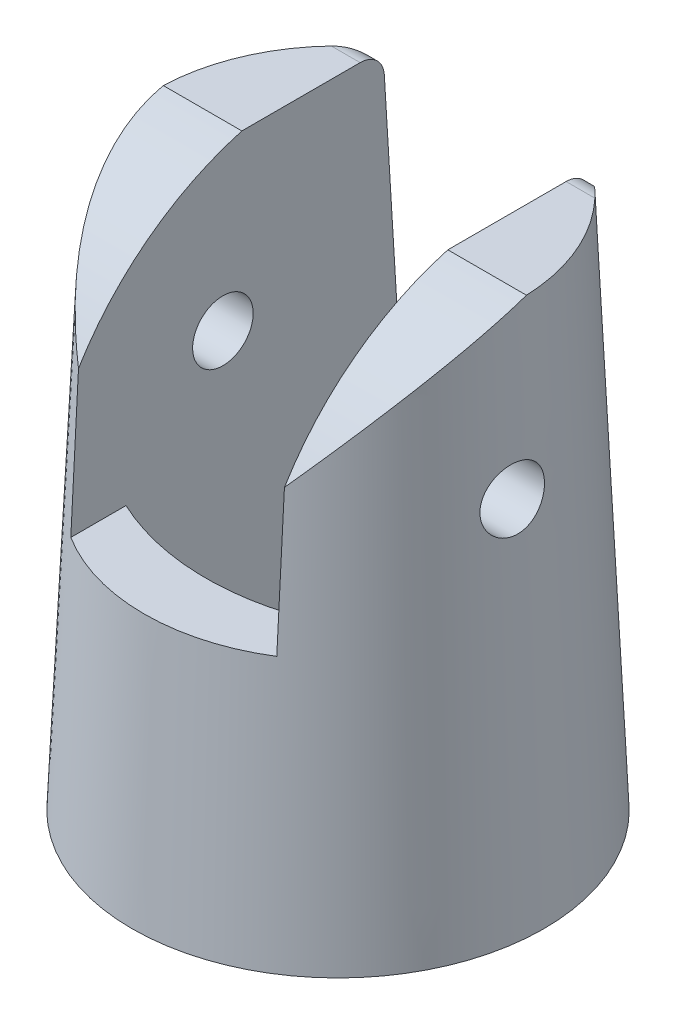
ISO-10303-21;
HEADER;
FILE_DESCRIPTION(('STEP AP214'),'2;1');
FILE_NAME('part.step','',(''),(''),'','','');
FILE_SCHEMA(('AUTOMOTIVE_DESIGN { 1 0 10303 214 1 1 1 1 }'));
ENDSEC;
DATA;
#1=APPLICATION_CONTEXT('core data for automotive mechanical design processes');
#2=APPLICATION_PROTOCOL_DEFINITION('international standard','automotive_design',2000,#1);
#3=PRODUCT_CONTEXT('',#1,'mechanical');
#4=PRODUCT('Part','Part','',(#3));
#5=PRODUCT_RELATED_PRODUCT_CATEGORY('part','',(#4));
#6=PRODUCT_DEFINITION_FORMATION('','',#4);
#7=PRODUCT_DEFINITION_CONTEXT('part definition',#1,'design');
#8=PRODUCT_DEFINITION('design','',#6,#7);
#9=PRODUCT_DEFINITION_SHAPE('','',#8);
#10=(LENGTH_UNIT() NAMED_UNIT(*) SI_UNIT(.MILLI.,.METRE.));
#11=(NAMED_UNIT(*) PLANE_ANGLE_UNIT() SI_UNIT($,.RADIAN.));
#12=(NAMED_UNIT(*) SI_UNIT($,.STERADIAN.) SOLID_ANGLE_UNIT());
#13=UNCERTAINTY_MEASURE_WITH_UNIT(LENGTH_MEASURE(1.E-05),#10,'distance_accuracy_value','');
#14=(GEOMETRIC_REPRESENTATION_CONTEXT(3) GLOBAL_UNCERTAINTY_ASSIGNED_CONTEXT((#13)) GLOBAL_UNIT_ASSIGNED_CONTEXT((#10,
#11,#12)) REPRESENTATION_CONTEXT('',''));
#15=CARTESIAN_POINT('',(0.,0.,0.));
#16=DIRECTION('',(0.,0.,1.));
#17=DIRECTION('',(1.,0.,0.));
#18=AXIS2_PLACEMENT_3D('',#15,#16,#17);
#19=CARTESIAN_POINT('',(-4.25,11.,10.));
#20=DIRECTION('',(0.,1.,0.));
#21=DIRECTION('',(0.,0.,1.));
#22=AXIS2_PLACEMENT_3D('',#19,#20,#21);
#23=PLANE('',#22);
#24=CARTESIAN_POINT('',(0.,11.,-4.55193349511584));
#25=DIRECTION('',(0.,1.,0.));
#26=DIRECTION('',(0.,0.,1.));
#27=AXIS2_PLACEMENT_3D('',#24,#25,#26);
#28=CIRCLE('',#27,10.);
#29=CARTESIAN_POINT('',(-4.25,11.,4.5));
#30=VERTEX_POINT('',#29);
#31=CARTESIAN_POINT('',(4.25,11.,4.5));
#32=VERTEX_POINT('',#31);
#33=EDGE_CURVE('E169',#30,#32,#28,.T.);
#34=ORIENTED_EDGE('',*,*,#33,.F.);
#35=DIRECTION('',(0.,0.,-1.));
#36=VECTOR('',#35,1.);
#37=CARTESIAN_POINT('',(-4.25,11.,10.));
#38=LINE('',#37,#36);
#39=CARTESIAN_POINT('',(-4.25,11.,6.77772085586298));
#40=VERTEX_POINT('',#39);
#41=EDGE_CURVE('E233',#40,#30,#38,.T.);
#42=ORIENTED_EDGE('',*,*,#41,.F.);
#43=CARTESIAN_POINT('',(0.,11.,0.));
#44=DIRECTION('',(0.,1.,0.));
#45=DIRECTION('',(0.,0.,1.));
#46=AXIS2_PLACEMENT_3D('',#43,#44,#45);
#47=CIRCLE('',#46,8.);
#48=CARTESIAN_POINT('',(4.25,11.,6.77772085586298));
#49=VERTEX_POINT('',#48);
#50=EDGE_CURVE('E342',#49,#40,#47,.F.);
#51=ORIENTED_EDGE('',*,*,#50,.F.);
#52=DIRECTION('',(0.,0.,-1.));
#53=VECTOR('',#52,1.);
#54=CARTESIAN_POINT('',(4.25,11.,10.));
#55=LINE('',#54,#53);
#56=EDGE_CURVE('E229',#49,#32,#55,.T.);
#57=ORIENTED_EDGE('',*,*,#56,.T.);
#58=EDGE_LOOP('',(#34,#42,#51,#57));
#59=FACE_BOUND('',#58,.T.);
#60=ADVANCED_FACE('F37',(#59),#23,.T.);
#61=CARTESIAN_POINT('',(0.,22.,0.));
#62=DIRECTION('',(0.,1.,0.));
#63=DIRECTION('',(0.,0.,1.));
#64=AXIS2_PLACEMENT_3D('',#61,#62,#63);
#65=PLANE('',#64);
#66=DIRECTION('',(0.,0.,-1.));
#67=VECTOR('',#66,1.);
#68=CARTESIAN_POINT('',(-4.25,22.,0.));
#69=LINE('',#68,#67);
#70=CARTESIAN_POINT('',(-4.25,22.,-0.282780766378372));
#71=VERTEX_POINT('',#70);
#72=CARTESIAN_POINT('',(-4.25,22.,-5.16422596730198));
#73=VERTEX_POINT('',#72);
#74=EDGE_CURVE('E243',#71,#73,#69,.T.);
#75=ORIENTED_EDGE('',*,*,#74,.T.);
#76=DIRECTION('',(1.,0.,0.));
#77=VECTOR('',#76,1.);
#78=CARTESIAN_POINT('',(-4.35658145321195,22.,-5.16422596730198));
#79=LINE('',#78,#77);
#80=CARTESIAN_POINT('',(-5.438821816591,22.,-5.16422557510443));
#81=VERTEX_POINT('',#80);
#82=EDGE_CURVE('E12',#73,#81,#79,.F.);
#83=ORIENTED_EDGE('',*,*,#82,.T.);
#84=CARTESIAN_POINT('',(0.,22.,0.));
#85=DIRECTION('',(0.,1.,0.));
#86=DIRECTION('',(0.,0.,1.));
#87=AXIS2_PLACEMENT_3D('',#84,#85,#86);
#88=CIRCLE('',#87,7.5);
#89=CARTESIAN_POINT('',(-7.49466710656093,22.,-0.282780766378366));
#90=VERTEX_POINT('',#89);
#91=EDGE_CURVE('E266',#81,#90,#88,.T.);
#92=ORIENTED_EDGE('',*,*,#91,.T.);
#93=DIRECTION('',(-1.,0.,0.));
#94=VECTOR('',#93,1.);
#95=CARTESIAN_POINT('',(10.,22.,-0.282780766378372));
#96=LINE('',#95,#94);
#97=EDGE_CURVE('E223',#71,#90,#96,.T.);
#98=ORIENTED_EDGE('',*,*,#97,.F.);
#99=EDGE_LOOP('',(#75,#83,#92,#98));
#100=FACE_BOUND('',#99,.T.);
#101=ADVANCED_FACE('F301',(#100),#65,.T.);
#102=CARTESIAN_POINT('',(7.49466710656093,22.,-0.282780766378372));
#103=VERTEX_POINT('',#102);
#104=CARTESIAN_POINT('',(5.43882208829554,22.,-5.16422548309984));
#105=VERTEX_POINT('',#104);
#106=EDGE_CURVE('E262',#103,#105,#88,.T.);
#107=ORIENTED_EDGE('',*,*,#106,.T.);
#108=DIRECTION('',(1.,0.,0.));
#109=VECTOR('',#108,1.);
#110=CARTESIAN_POINT('',(4.25,22.,-5.16422596730198));
#111=LINE('',#110,#109);
#112=CARTESIAN_POINT('',(4.25,22.,-5.16422596730198));
#113=VERTEX_POINT('',#112);
#114=EDGE_CURVE('E250',#105,#113,#111,.F.);
#115=ORIENTED_EDGE('',*,*,#114,.T.);
#116=DIRECTION('',(0.,0.,1.));
#117=VECTOR('',#116,1.);
#118=CARTESIAN_POINT('',(4.25,22.,0.));
#119=LINE('',#118,#117);
#120=CARTESIAN_POINT('',(4.25,22.,-0.282780766378372));
#121=VERTEX_POINT('',#120);
#122=EDGE_CURVE('E235',#113,#121,#119,.T.);
#123=ORIENTED_EDGE('',*,*,#122,.T.);
#124=DIRECTION('',(-1.,0.,0.));
#125=VECTOR('',#124,1.);
#126=CARTESIAN_POINT('',(10.,22.,-0.282780766378372));
#127=LINE('',#126,#125);
#128=EDGE_CURVE('E185',#103,#121,#127,.T.);
#129=ORIENTED_EDGE('',*,*,#128,.F.);
#130=EDGE_LOOP('',(#107,#115,#123,#129));
#131=FACE_BOUND('',#130,.T.);
#132=ADVANCED_FACE('F307',(#131),#65,.T.);
#133=CARTESIAN_POINT('',(0.,22.,0.));
#134=DIRECTION('',(0.,-1.,0.));
#135=DIRECTION('',(0.,0.,-1.));
#136=AXIS2_PLACEMENT_3D('',#133,#134,#135);
#137=CONICAL_SURFACE('',#136,7.5,0.0454232794215771);
#138=CARTESIAN_POINT('',(-7.83796735688722,14.3622174893562,-0.379967166316534));
#139=CARTESIAN_POINT('',(-7.84258137245685,14.3133454888,-0.330657672658893));
#140=CARTESIAN_POINT('',(-7.84674066486493,14.2685433740009,-0.277221256144544));
#141=CARTESIAN_POINT('',(-7.8535770197042,14.1883770300518,-0.163551374229647));
#142=CARTESIAN_POINT('',(-7.85625291943775,14.1530202154338,-0.103312621478255));
#143=CARTESIAN_POINT('',(-7.8596375423327,14.0927931436459,0.0222748852102689));
#144=CARTESIAN_POINT('',(-7.86034581452373,14.067925291601,0.0876248070735859));
#145=CARTESIAN_POINT('',(-7.85946228431654,14.0294247957157,0.221525428298114));
#146=CARTESIAN_POINT('',(-7.85787100492778,14.0157895982304,0.290075396410402));
#147=CARTESIAN_POINT('',(-7.85228410719661,14.0001840444117,0.427766064798723));
#148=CARTESIAN_POINT('',(-7.84831020572619,13.9981100486801,0.496895934210147));
#149=CARTESIAN_POINT('',(-7.83806545214515,14.0053392217948,0.634384128941268));
#150=CARTESIAN_POINT('',(-7.83179450336468,14.014642869501,0.702742421664802));
#151=CARTESIAN_POINT('',(-7.81722601313375,14.0443276298967,0.837049248229589));
#152=CARTESIAN_POINT('',(-7.80892100022893,14.0647499293699,0.902987843329569));
#153=CARTESIAN_POINT('',(-7.790775888944,14.1160446525726,1.03043929857791));
#154=CARTESIAN_POINT('',(-7.78093560413196,14.1469183459746,1.09195161990537));
#155=CARTESIAN_POINT('',(-7.76010966108363,14.2190054175936,1.21024682770151));
#156=CARTESIAN_POINT('',(-7.74910385329152,14.2604277357386,1.26689885331061));
#157=CARTESIAN_POINT('',(-7.72687097524336,14.3521248730564,1.37247369304183));
#158=CARTESIAN_POINT('',(-7.71564387723456,14.4024008089463,1.42139553066781));
#159=CARTESIAN_POINT('',(-7.69356264148555,14.5114011926656,1.51095465792816));
#160=CARTESIAN_POINT('',(-7.68271790805299,14.5702531136188,1.55143935878097));
#161=CARTESIAN_POINT('',(-7.6623986074272,14.6941689491704,1.62188693084612));
#162=CARTESIAN_POINT('',(-7.65292397084745,14.7592325489103,1.65185033500368));
#163=CARTESIAN_POINT('',(-7.63612434840078,14.8931135922155,1.70006025493109));
#164=CARTESIAN_POINT('',(-7.628779504597,14.9618887622122,1.71841702637262));
#165=CARTESIAN_POINT('',(-7.61663038843077,15.1017712667087,1.74320996212474));
#166=CARTESIAN_POINT('',(-7.61182564575986,15.1728781668894,1.74964833372071));
#167=CARTESIAN_POINT('',(-7.60511802104365,15.3134015003158,1.75031471224994));
#168=CARTESIAN_POINT('',(-7.60314193334666,15.3828130458677,1.74486034008846));
#169=CARTESIAN_POINT('',(-7.60185272747497,15.5197905645542,1.72250877153392));
#170=CARTESIAN_POINT('',(-7.60253942022953,15.5873566683814,1.70561238765126));
#171=CARTESIAN_POINT('',(-7.60630351713635,15.7179091624343,1.66114648990012));
#172=CARTESIAN_POINT('',(-7.60935259794971,15.7809402068652,1.63370535133399));
#173=CARTESIAN_POINT('',(-7.61736988938797,15.9015696424095,1.5689454281796));
#174=CARTESIAN_POINT('',(-7.62233823791652,15.9591676427765,1.53162593387021));
#175=CARTESIAN_POINT('',(-7.63370221314921,16.0681355426512,1.44760265700419));
#176=CARTESIAN_POINT('',(-7.64011600940821,16.1194120265777,1.40078023978353));
#177=CARTESIAN_POINT('',(-7.65367838854403,16.2134837982302,1.29936472333884));
#178=CARTESIAN_POINT('',(-7.66082704856748,16.2562781941154,1.24477080802427));
#179=CARTESIAN_POINT('',(-7.67534091282203,16.3329515652811,1.12822611342176));
#180=CARTESIAN_POINT('',(-7.68270769514751,16.3666553047501,1.06616013918209));
#181=CARTESIAN_POINT('',(-7.69691604657131,16.423165976049,0.937193488415529));
#182=CARTESIAN_POINT('',(-7.70375760872745,16.4459727638678,0.870292748007196));
#183=CARTESIAN_POINT('',(-7.71644262030627,16.4800561197651,0.73334943158845));
#184=CARTESIAN_POINT('',(-7.72228364732094,16.4913050247458,0.663299734651518));
#185=CARTESIAN_POINT('',(-7.73262752673949,16.5018027282445,0.522209650757891));
#186=CARTESIAN_POINT('',(-7.73713045599583,16.5010522160741,0.451169320942772));
#187=CARTESIAN_POINT('',(-7.74464533464226,16.4875918161016,0.310815334039046));
#188=CARTESIAN_POINT('',(-7.74767065771755,16.4749923395032,0.241491793203629));
#189=CARTESIAN_POINT('',(-7.7523770032345,16.4383254425338,0.105900144542275));
#190=CARTESIAN_POINT('',(-7.75405805542838,16.4142582759914,0.0396319691237624));
#191=CARTESIAN_POINT('',(-7.75633448543182,16.3554710465647,-0.0876438503397964));
#192=CARTESIAN_POINT('',(-7.75693482435448,16.3208005225005,-0.148674301814935));
#193=CARTESIAN_POINT('',(-7.75745954559994,16.2417479395246,-0.264086768502954));
#194=CARTESIAN_POINT('',(-7.75738391180716,16.1973656491035,-0.318468625178237));
#195=CARTESIAN_POINT('',(-7.75702698900383,16.0999847315327,-0.419211339047032));
#196=CARTESIAN_POINT('',(-7.75674504948525,16.0469592633596,-0.465546250063089));
#197=CARTESIAN_POINT('',(-7.75646152768906,15.9338912875552,-0.548673610293639));
#198=CARTESIAN_POINT('',(-7.75645994636058,15.873848756169,-0.585466027202548));
#199=CARTESIAN_POINT('',(-7.75716824579797,15.7483571213731,-0.648511138791821));
#200=CARTESIAN_POINT('',(-7.75787915678735,15.6829003149688,-0.674748494466434));
#201=CARTESIAN_POINT('',(-7.76032771935512,15.5485315888061,-0.715859664595585));
#202=CARTESIAN_POINT('',(-7.76206531536022,15.4796198562436,-0.730734094012506));
#203=CARTESIAN_POINT('',(-7.76670676584568,15.3405207125203,-0.748683187532378));
#204=CARTESIAN_POINT('',(-7.76960720822943,15.2703376022251,-0.751792098543693));
#205=CARTESIAN_POINT('',(-7.77652868962862,15.130481192041,-0.74623974442389));
#206=CARTESIAN_POINT('',(-7.78054994377231,15.0608079926616,-0.737576218456636));
#207=CARTESIAN_POINT('',(-7.78948146542229,14.9238460238463,-0.708730903239069));
#208=CARTESIAN_POINT('',(-7.79439304167692,14.8565609413452,-0.688532062131407));
#209=CARTESIAN_POINT('',(-7.80469362494343,14.7263866758636,-0.637196842199327));
#210=CARTESIAN_POINT('',(-7.8100822334847,14.6634939010552,-0.606069528773817));
#211=CARTESIAN_POINT('',(-7.8193813436165,14.5597286320879,-0.543391023811535));
#212=CARTESIAN_POINT('',(-7.82330433193733,14.5174439551711,-0.514147846605545));
#213=CARTESIAN_POINT('',(-7.83089031896814,14.4367692624713,-0.450678665707523));
#214=CARTESIAN_POINT('',(-7.83455331694851,14.3983792576176,-0.416452648032943));
#215=CARTESIAN_POINT('',(-7.83796735688722,14.3622174893562,-0.379967166316534));
#216=B_SPLINE_CURVE_WITH_KNOTS('',3,(#138,#139,#140,#141,#142,#143,#144,#145,#146,#147,#148,
#149,#150,#151,#152,#153,#154,#155,#156,#157,#158,#159,#160,#161,#162,#163,#164,#165,#166,#167,
#168,#169,#170,#171,#172,#173,#174,#175,#176,#177,#178,#179,#180,#181,#182,#183,#184,#185,#186,
#187,#188,#189,#190,#191,#192,#193,#194,#195,#196,#197,#198,#199,#200,#201,#202,#203,#204,#205,
#206,#207,#208,#209,#210,#211,#212,#213,#214,#215),.UNSPECIFIED.,.T.,.F.,(4,2,2,2,2,2,2,2,2,2,2,
2,2,2,2,2,2,2,2,2,2,2,2,2,2,2,2,2,2,2,2,2,2,2,2,2,2,2,4),(0.,0.208553037536982,
0.417269310681503,0.626033416602672,0.834750048737337,1.04159261254212,1.24844388219199,
1.45606665596537,1.66371466154781,1.87584802928522,2.08800817283941,2.30372407188203,
2.5194290424861,2.73305288682505,2.94663716410913,3.1545872325207,3.36252253570734,
3.56800270522751,3.77349764170112,3.98173607251478,4.18999638674758,4.40202316410761,
4.61405274347573,4.82658862900881,5.03911230536931,5.24967505863844,5.46023315147819,
5.66982216909493,5.87941618344591,6.08967393764611,6.29993240365298,6.51049533073528,
6.72104686132943,6.93098504794489,7.14096355781078,7.3512532707934,7.56136895456365,
7.7156827817969,7.86999704206467),.UNSPECIFIED.);
#217=CARTESIAN_POINT('',(-7.83796735688722,14.3622174893562,-0.379967166316534));
#218=VERTEX_POINT('',#217);
#219=EDGE_CURVE('E513',#218,#218,#216,.T.);
#220=ORIENTED_EDGE('',*,*,#219,.F.);
#221=EDGE_LOOP('',(#220));
#222=FACE_BOUND('',#221,.T.);
#223=CARTESIAN_POINT('',(7.83796735688722,14.3622174893562,-0.379967166316534));
#224=CARTESIAN_POINT('',(7.83328744997076,14.411786493911,-0.429972551895008));
#225=CARTESIAN_POINT('',(7.82813491145327,14.4655970435523,-0.475788374346395));
#226=CARTESIAN_POINT('',(7.81750342359286,14.5801753249335,-0.557736154925303));
#227=CARTESIAN_POINT('',(7.81202413824418,14.6409502797276,-0.593857926863399));
#228=CARTESIAN_POINT('',(7.80132350845169,14.7677115943127,-0.655359958784006));
#229=CARTESIAN_POINT('',(7.79610206849342,14.8336960004513,-0.68074422306178));
#230=CARTESIAN_POINT('',(7.78639291034306,14.9690294601727,-0.720049024368096));
#231=CARTESIAN_POINT('',(7.78190500745661,15.0383776610788,-0.733972450649715));
#232=CARTESIAN_POINT('',(7.77399091836468,15.1783689326216,-0.749929222930623));
#233=CARTESIAN_POINT('',(7.77056291818221,15.2490095693085,-0.751982991142016));
#234=CARTESIAN_POINT('',(7.76489197262361,15.3896780692755,-0.744167192422135));
#235=CARTESIAN_POINT('',(7.76264903265032,15.4597059297606,-0.73429757113135));
#236=CARTESIAN_POINT('',(7.75929248978818,15.5967220156707,-0.702993570327684));
#237=CARTESIAN_POINT('',(7.75817236040506,15.6637256196513,-0.681627146744598));
#238=CARTESIAN_POINT('',(7.75679365361985,15.7932173640281,-0.627974577793197));
#239=CARTESIAN_POINT('',(7.75653508331722,15.8557054672114,-0.5956883424456));
#240=CARTESIAN_POINT('',(7.75649444526569,15.9744166240331,-0.521095827758257));
#241=CARTESIAN_POINT('',(7.7567125622039,16.0306372405351,-0.478785670425266));
#242=CARTESIAN_POINT('',(7.75715624655791,16.1351989223126,-0.38534680301936));
#243=CARTESIAN_POINT('',(7.75738181406936,16.1835398863793,-0.334217979693814));
#244=CARTESIAN_POINT('',(7.75735277244982,16.2710823014537,-0.224452008036307));
#245=CARTESIAN_POINT('',(7.75709699967637,16.31026134601,-0.165796984553421));
#246=CARTESIAN_POINT('',(7.75566157635508,16.3782114671868,-0.0427503856031519));
#247=CARTESIAN_POINT('',(7.75448195024235,16.406982819052,0.0216410381015896));
#248=CARTESIAN_POINT('',(7.75087513937824,16.4532417161059,0.154138010703878));
#249=CARTESIAN_POINT('',(7.74845117341741,16.4707581130484,0.222233573597008));
#250=CARTESIAN_POINT('',(7.74219359590397,16.4941450998807,0.360331220773845));
#251=CARTESIAN_POINT('',(7.73836001268759,16.5000159238554,0.430333266707118));
#252=CARTESIAN_POINT('',(7.72932068479677,16.4999840438097,0.570093595387191));
#253=CARTESIAN_POINT('',(7.72411787249586,16.4941063254208,0.639852080057968));
#254=CARTESIAN_POINT('',(7.71255950790742,16.4708408417028,0.777323498526293));
#255=CARTESIAN_POINT('',(7.70620390189043,16.4534525397877,0.845036336808613));
#256=CARTESIAN_POINT('',(7.69269658051719,16.4075370442686,0.976990666341749));
#257=CARTESIAN_POINT('',(7.68553992325761,16.3789376360297,1.04120651486163));
#258=CARTESIAN_POINT('',(7.67101803808324,16.3114123472423,1.16393536511896));
#259=CARTESIAN_POINT('',(7.66365279507404,16.2724857176454,1.22244795276949));
#260=CARTESIAN_POINT('',(7.64930430545073,16.1849979103186,1.33262702154622));
#261=CARTESIAN_POINT('',(7.64232472712915,16.1363596199086,1.38423279897497));
#262=CARTESIAN_POINT('',(7.62951784340339,16.0309808458313,1.4785542987219));
#263=CARTESIAN_POINT('',(7.62369050222643,15.9742406137942,1.52127029703761));
#264=CARTESIAN_POINT('',(7.61388677149647,15.8546071582144,1.59631412815498));
#265=CARTESIAN_POINT('',(7.60989910971896,15.7917543426828,1.62870483824421));
#266=CARTESIAN_POINT('',(7.60426405732497,15.6614026873648,1.68246189666889));
#267=CARTESIAN_POINT('',(7.60261632102336,15.5939045353947,1.70382987313305));
#268=CARTESIAN_POINT('',(7.60201413428632,15.4576064065578,1.73457894238311));
#269=CARTESIAN_POINT('',(7.60300775882109,15.3888575301053,1.74418579213573));
#270=CARTESIAN_POINT('',(7.60767099089208,15.2508115759145,1.75190966695364));
#271=CARTESIAN_POINT('',(7.61134043696361,15.1815145315033,1.75002738524674));
#272=CARTESIAN_POINT('',(7.62115557547188,15.0449328497942,1.73496140239145));
#273=CARTESIAN_POINT('',(7.62728047676171,14.9776362883151,1.72187156798986));
#274=CARTESIAN_POINT('',(7.6416294406344,14.8462855334842,1.68497664018864));
#275=CARTESIAN_POINT('',(7.64985369677373,14.7822316397532,1.66117055861715));
#276=CARTESIAN_POINT('',(7.66801243401358,14.6579498642628,1.6030701895091));
#277=CARTESIAN_POINT('',(7.6779742216434,14.5978081122334,1.56860035291659));
#278=CARTESIAN_POINT('',(7.69881665045785,14.4841316963163,1.49030840998256));
#279=CARTESIAN_POINT('',(7.70969743522397,14.4305980680908,1.44648484060131));
#280=CARTESIAN_POINT('',(7.73191396506617,14.3302369345709,1.34942943943223));
#281=CARTESIAN_POINT('',(7.74325425905537,14.2836130542963,1.29598786361171));
#282=CARTESIAN_POINT('',(7.76532822275802,14.200004007431,1.18191600547704));
#283=CARTESIAN_POINT('',(7.77606186415307,14.1630192905038,1.12128538798862));
#284=CARTESIAN_POINT('',(7.79623886870943,14.0996284747101,0.994176429544855));
#285=CARTESIAN_POINT('',(7.80567632874684,14.073269780279,0.927673462984205));
#286=CARTESIAN_POINT('',(7.82259046158376,14.0322318910173,0.790920827608197));
#287=CARTESIAN_POINT('',(7.83006744861704,14.017550823674,0.720671761410059));
#288=CARTESIAN_POINT('',(7.84250930031314,14.0005847034211,0.579912298187302));
#289=CARTESIAN_POINT('',(7.84752147606881,13.9980572854591,0.509435309955935));
#290=CARTESIAN_POINT('',(7.85506980203676,14.0049041647396,0.3689156843286));
#291=CARTESIAN_POINT('',(7.85760577766391,14.0142793010676,0.298873077904731));
#292=CARTESIAN_POINT('',(7.86022591507369,14.0444071543172,0.162619905603529));
#293=CARTESIAN_POINT('',(7.86035508572819,14.0649435994135,0.096362149741156));
#294=CARTESIAN_POINT('',(7.85853055532961,14.1166536842147,-0.0317812303583431));
#295=CARTESIAN_POINT('',(7.85657877647283,14.1478174892377,-0.0936708332501011));
#296=CARTESIAN_POINT('',(7.85185318686241,14.2090525709101,-0.193735923866125));
#297=CARTESIAN_POINT('',(7.84950029916606,14.2366587523309,-0.233464626389801));
#298=CARTESIAN_POINT('',(7.844161430126,14.2962513658329,-0.309440878422375));
#299=CARTESIAN_POINT('',(7.84117544129214,14.3282378497355,-0.345688386738222));
#300=CARTESIAN_POINT('',(7.83796735688722,14.3622174893562,-0.379967166316534));
#301=B_SPLINE_CURVE_WITH_KNOTS('',3,(#223,#224,#225,#226,#227,#228,#229,#230,#231,#232,#233,
#234,#235,#236,#237,#238,#239,#240,#241,#242,#243,#244,#245,#246,#247,#248,#249,#250,#251,#252,
#253,#254,#255,#256,#257,#258,#259,#260,#261,#262,#263,#264,#265,#266,#267,#268,#269,#270,#271,
#272,#273,#274,#275,#276,#277,#278,#279,#280,#281,#282,#283,#284,#285,#286,#287,#288,#289,#290,
#291,#292,#293,#294,#295,#296,#297,#298,#299,#300),.UNSPECIFIED.,.T.,.F.,(4,2,2,2,2,2,2,2,2,2,2,
2,2,2,2,2,2,2,2,2,2,2,2,2,2,2,2,2,2,2,2,2,2,2,2,2,2,2,4),(0.,0.211521205247813,
0.423263807442014,0.634927375558793,0.846537567380181,1.0577835669305,1.26903052956875,
1.47904234258002,1.68905588613143,1.89915081148957,2.10924843516682,2.31985462343067,
2.53045524153484,2.74051381413052,2.95056816434615,3.16017626716106,3.36979414190905,
3.58078503094666,3.79179122764584,4.00454472861511,4.2172916233229,4.4287170558575,
4.6401112505464,4.84738064458982,5.05463753259738,5.26017537178874,5.46573216802022,
5.67487122393724,5.8840430157978,6.09850004920052,6.31296708515513,6.52838057854262,
6.74375952331146,6.95482510378299,7.16590556441396,7.37303463285966,7.57997253949852,
7.72496898140106,7.86996713883852),.UNSPECIFIED.);
#302=CARTESIAN_POINT('',(7.83796735688722,14.3622174893562,-0.379967166316534));
#303=VERTEX_POINT('',#302);
#304=EDGE_CURVE('E507',#303,#303,#301,.T.);
#305=ORIENTED_EDGE('',*,*,#304,.F.);
#306=EDGE_LOOP('',(#305));
#307=FACE_BOUND('',#306,.T.);
#308=CARTESIAN_POINT('',(0.,41.3966504623758,-4.91858206978573));
#309=DIRECTION('',(0.,-0.061048539534854,0.998134798421867));
#310=DIRECTION('',(0.,-0.998134798421867,-0.061048539534854));
#311=AXIS2_PLACEMENT_3D('',#308,#309,#310);
#312=ELLIPSE('',#311,108.411013929554,4.42830625448101);
#313=CARTESIAN_POINT('',(4.34940519150883,21.0610485395348,-6.16236076572385));
#314=VERTEX_POINT('',#313);
#315=CARTESIAN_POINT('',(4.25,11.,-6.77772085586298));
#316=VERTEX_POINT('',#315);
#317=EDGE_CURVE('E171',#314,#316,#312,.F.);
#318=ORIENTED_EDGE('',*,*,#317,.F.);
#319=CARTESIAN_POINT('',(4.34940519150883,21.0610485395349,-6.16236076572385));
#320=CARTESIAN_POINT('',(4.34960668817625,21.0960037714882,-6.16026639709529));
#321=CARTESIAN_POINT('',(4.35255770840583,21.1307027635223,-6.15626033932825));
#322=CARTESIAN_POINT('',(4.36323729220071,21.1984264149009,-6.14492437754313));
#323=CARTESIAN_POINT('',(4.37091464928772,21.2314649684895,-6.13763032047632));
#324=CARTESIAN_POINT('',(4.3927674187493,21.3034159998716,-6.11798905969393));
#325=CARTESIAN_POINT('',(4.40808163224176,21.3417552703831,-6.10483757135849));
#326=CARTESIAN_POINT('',(4.44349099131189,21.4147941627066,-6.07500114310349));
#327=CARTESIAN_POINT('',(4.46360781026385,21.4494762264571,-6.05830022381533));
#328=CARTESIAN_POINT('',(4.51834985809759,21.5317973235916,-6.01298583576456));
#329=CARTESIAN_POINT('',(4.55514250711387,21.5770255303745,-5.98264043640866));
#330=CARTESIAN_POINT('',(4.63324615227983,21.6597061595097,-5.91759225288077));
#331=CARTESIAN_POINT('',(4.67456645627655,21.6971420868919,-5.8828804698848));
#332=CARTESIAN_POINT('',(4.78221980236055,21.7828896509989,-5.79100629877273));
#333=CARTESIAN_POINT('',(4.8503074683537,21.8266110984243,-5.73161575598004));
#334=CARTESIAN_POINT('',(4.98881469902542,21.8995032525744,-5.60704864762353));
#335=CARTESIAN_POINT('',(5.05923576587386,21.9286643838315,-5.54186830754522));
#336=CARTESIAN_POINT('',(5.18172123590552,21.9668930634414,-5.4247129010371));
#337=CARTESIAN_POINT('',(5.23375859656191,21.9792240430582,-5.37375512147988));
#338=CARTESIAN_POINT('',(5.33701405608624,21.9957402272397,-5.27015891537571));
#339=CARTESIAN_POINT('',(5.38823463353786,21.9999585068014,-5.21752820599083));
#340=CARTESIAN_POINT('',(5.43882157834542,21.9999999999995,-5.16422499886717));
#341=B_SPLINE_CURVE_WITH_KNOTS('',3,(#319,#320,#321,#322,#323,#324,#325,#326,#327,#328,#329,
#330,#331,#332,#333,#334,#335,#336,#337,#338,#339,#340),.UNSPECIFIED.,.F.,.F.,(4,2,2,2,2,2,2,2,
2,2,4),(0.,0.104713635229163,0.208312266464569,0.337583019397058,0.467448560866493,
0.663534383733636,0.860031158880604,1.15956187798788,1.45928932231263,1.6804477134348,
1.9007025274968),.UNSPECIFIED.);
#342=EDGE_CURVE('E253',#314,#105,#341,.T.);
#343=ORIENTED_EDGE('',*,*,#342,.T.);
#344=ORIENTED_EDGE('',*,*,#106,.F.);
#345=CARTESIAN_POINT('',(3.92629643649929,16.4998,6.68182888151938));
#346=CARTESIAN_POINT('',(4.01931564514,16.6087596912144,6.62142155513562));
#347=CARTESIAN_POINT('',(4.11131934328455,16.7173930395185,6.55888032044954));
#348=CARTESIAN_POINT('',(4.2932260178552,16.9338412713703,6.42945464521689));
#349=CARTESIAN_POINT('',(4.38312886202439,17.0416561031024,6.36256993222782));
#350=CARTESIAN_POINT('',(4.64974442688335,17.3638214077866,6.15515905521457));
#351=CARTESIAN_POINT('',(4.82317510446661,17.5766708748424,6.00799843905382));
#352=CARTESIAN_POINT('',(5.16169686386746,17.9988471466584,5.69400575303419));
#353=CARTESIAN_POINT('',(5.32669369672939,18.208121685456,5.52700099956619));
#354=CARTESIAN_POINT('',(5.64481535638337,18.6193198754499,5.17407572809778));
#355=CARTESIAN_POINT('',(5.79794544197142,18.8212467614988,4.98816367438537));
#356=CARTESIAN_POINT('',(6.18554186312356,19.344583308023,4.46948304084846));
#357=CARTESIAN_POINT('',(6.40828324022354,19.6584689169281,4.11972189091382));
#358=CARTESIAN_POINT('',(6.70460657922282,20.1030052689049,3.55584345351292));
#359=CARTESIAN_POINT('',(6.79701231639435,20.2466767825226,3.36154965453657));
#360=CARTESIAN_POINT('',(6.96755426977346,20.5240954336224,2.95998057341705));
#361=CARTESIAN_POINT('',(7.04569416904946,20.6578451273514,2.7527086604966));
#362=CARTESIAN_POINT('',(7.17256638181405,20.8899099716306,2.36580838957839));
#363=CARTESIAN_POINT('',(7.22406541289287,20.9901763018322,2.18825189066998));
#364=CARTESIAN_POINT('',(7.31510853322135,21.1822314807992,1.82566056472446));
#365=CARTESIAN_POINT('',(7.35465549431912,21.2740223623616,1.64062754628174));
#366=CARTESIAN_POINT('',(7.42056862050664,21.4481005988231,1.26431410365367));
#367=CARTESIAN_POINT('',(7.44696120414356,21.5304067445339,1.0730470299074));
#368=CARTESIAN_POINT('',(7.48555616887137,21.6848871796944,0.68514833352627));
#369=CARTESIAN_POINT('',(7.49776772335813,21.757067992397,0.48852026316183));
#370=CARTESIAN_POINT('',(7.50462208608418,21.8557629190509,0.195068954102029));
#371=CARTESIAN_POINT('',(7.50510898755003,21.8864428593324,0.0997400677496214));
#372=CARTESIAN_POINT('',(7.50253793378852,21.9452762371562,-0.0915936069798442));
#373=CARTESIAN_POINT('',(7.49948176524655,21.9734309404044,-0.187598030443378));
#374=CARTESIAN_POINT('',(7.49461138166237,22.0003080623876,-0.28388412339532));
#375=B_SPLINE_CURVE_WITH_KNOTS('',3,(#345,#346,#347,#348,#349,#350,#351,#352,#353,#354,#355,
#356,#357,#358,#359,#360,#361,#362,#363,#364,#365,#366,#367,#368,#369,#370,#371,#372,#373,#374),
.UNSPECIFIED.,.F.,.F.,(4,2,2,2,2,2,2,2,2,2,2,2,2,2,4),(0.,0.466403210186573,0.932835703589585,
1.86664716605778,2.8092792869606,3.75149125909967,5.30530822586806,6.08073041777247,
6.85595213185147,7.48631450141871,8.11652528662495,8.74546523819607,9.37399811531518,
9.67435061674296,9.97455172345294),.UNSPECIFIED.);
#376=CARTESIAN_POINT('',(4.25,16.8824851749416,6.45993994327909));
#377=VERTEX_POINT('',#376);
#378=EDGE_CURVE('E183',#377,#103,#375,.T.);
#379=ORIENTED_EDGE('',*,*,#378,.F.);
#380=CARTESIAN_POINT('',(4.24999999999999,28.8057765116834,5.80024977110232));
#381=CARTESIAN_POINT('',(4.24999999999999,26.2989672472569,5.9414803133123));
#382=CARTESIAN_POINT('',(4.25,23.7920608816099,6.08097461329277));
#383=CARTESIAN_POINT('',(4.25,18.7780890989142,6.35703244550604));
#384=CARTESIAN_POINT('',(4.25,16.2710236820206,6.49359598055445));
#385=CARTESIAN_POINT('',(4.25,11.2567649375485,6.76433422535382));
#386=CARTESIAN_POINT('',(4.25,8.74957161001142,6.89850893587335));
#387=CARTESIAN_POINT('',(4.25,3.73507492544163,7.16483292436775));
#388=CARTESIAN_POINT('',(4.25,1.22777156830585,7.29698220040266));
#389=CARTESIAN_POINT('',(4.25,-1.27957505847372,7.42830030504297));
#390=B_SPLINE_CURVE_WITH_KNOTS('',3,(#380,#381,#382,#383,#384,#385,#386,#387,#388,#389),
.UNSPECIFIED.,.F.,.F.,(4,2,2,2,4),(0.,7.5323518408429,15.0646964449593,22.5970386255993,
30.129388020287),.UNSPECIFIED.);
#391=EDGE_CURVE('E347',#377,#49,#390,.T.);
#392=ORIENTED_EDGE('',*,*,#391,.T.);
#393=ORIENTED_EDGE('',*,*,#50,.T.);
#394=CARTESIAN_POINT('',(-4.25,-1.27957505847371,7.42830030504297));
#395=CARTESIAN_POINT('',(-4.25,1.22777156830585,7.29698220040253));
#396=CARTESIAN_POINT('',(-4.25,3.73507492544163,7.16483292436767));
#397=CARTESIAN_POINT('',(-4.25,8.74957161001142,6.89850893587343));
#398=CARTESIAN_POINT('',(-4.25,11.2567649375485,6.764334225354));
#399=CARTESIAN_POINT('',(-4.25,16.2710236820206,6.49359598055463));
#400=CARTESIAN_POINT('',(-4.25,18.7780890989142,6.35703244550611));
#401=CARTESIAN_POINT('',(-4.25,23.7920608816099,6.08097461329268));
#402=CARTESIAN_POINT('',(-4.25000000000001,26.2989672472569,5.94148031331217));
#403=CARTESIAN_POINT('',(-4.25,28.8057765116834,5.80024977110231));
#404=B_SPLINE_CURVE_WITH_KNOTS('',3,(#394,#395,#396,#397,#398,#399,#400,#401,#402,#403),
.UNSPECIFIED.,.F.,.F.,(4,2,2,2,4),(0.,7.53234939468772,15.0646915753277,22.5970361794441,
30.129388020287),.UNSPECIFIED.);
#405=CARTESIAN_POINT('',(-4.25,16.8824851749416,6.45993994327909));
#406=VERTEX_POINT('',#405);
#407=EDGE_CURVE('E340',#40,#406,#404,.T.);
#408=ORIENTED_EDGE('',*,*,#407,.T.);
#409=CARTESIAN_POINT('',(-7.49461138166237,22.0003080623876,-0.28388412339532));
#410=CARTESIAN_POINT('',(-7.49988309951068,21.9712190846278,-0.179671951668641));
#411=CARTESIAN_POINT('',(-7.50302890185525,21.9406327300934,-0.0757903670246975));
#412=CARTESIAN_POINT('',(-7.50517997220749,21.876530339592,0.13109451540663));
#413=CARTESIAN_POINT('',(-7.50418576359576,21.8430146744732,0.234097922563612));
#414=CARTESIAN_POINT('',(-7.49516957751024,21.7382570709262,0.54121921764491));
#415=CARTESIAN_POINT('',(-7.48112808840113,21.6627231332624,0.743739635876401));
#416=CARTESIAN_POINT('',(-7.43828077256935,21.5017611807683,1.14094177768584));
#417=CARTESIAN_POINT('',(-7.40961241381115,21.4164309208909,1.33567859826578));
#418=CARTESIAN_POINT('',(-7.33878245591829,21.2361607157852,1.71816731631631));
#419=CARTESIAN_POINT('',(-7.29661717605367,21.1412181540315,1.90591729280399));
#420=CARTESIAN_POINT('',(-7.20026737266868,20.9431335214884,2.27261940341223));
#421=CARTESIAN_POINT('',(-7.1461407509817,20.8400324372421,2.45160901155736));
#422=CARTESIAN_POINT('',(-7.02698361077534,20.6261840787999,2.80110168903546));
#423=CARTESIAN_POINT('',(-6.96195399000715,20.5154374345796,2.97160545559348));
#424=CARTESIAN_POINT('',(-6.75179546283551,20.1723044580087,3.47084807264812));
#425=CARTESIAN_POINT('',(-6.59184775246264,19.9295259920633,3.78640217377691));
#426=CARTESIAN_POINT('',(-6.27814664729068,19.476767736348,4.31768661392711));
#427=CARTESIAN_POINT('',(-6.13025157024551,19.2707265163302,4.54040677859332));
#428=CARTESIAN_POINT('',(-5.81823735113368,18.8479886062566,4.96354041807549));
#429=CARTESIAN_POINT('',(-5.65410913328027,18.6312859899342,5.16394127976161));
#430=CARTESIAN_POINT('',(-5.31234904088311,18.1896276284259,5.54273628503243));
#431=CARTESIAN_POINT('',(-5.13471803279778,17.9646724132781,5.72113183874884));
#432=CARTESIAN_POINT('',(-4.76799729772391,17.5085184045354,6.05655537735724));
#433=CARTESIAN_POINT('',(-4.57891334851169,17.2773227911971,6.21359400873509));
#434=CARTESIAN_POINT('',(-4.30977503143093,16.9537346128282,6.41700145308093));
#435=CARTESIAN_POINT('',(-4.23399982905615,16.8632054471757,6.47215899836824));
#436=CARTESIAN_POINT('',(-4.08115145722696,16.6817932779821,6.57931295355229));
#437=CARTESIAN_POINT('',(-4.00408158775142,16.5909115269953,6.63131618955329));
#438=CARTESIAN_POINT('',(-3.92629643649941,16.4997999999999,6.68182888151944));
#439=B_SPLINE_CURVE_WITH_KNOTS('',3,(#409,#410,#411,#412,#413,#414,#415,#416,#417,#418,#419,
#420,#421,#422,#423,#424,#425,#426,#427,#428,#429,#430,#431,#432,#433,#434,#435,#436,#437,#438),
.UNSPECIFIED.,.F.,.F.,(4,2,2,2,2,2,2,2,2,2,2,2,2,2,4),(0.,0.324904791494705,0.649768509741711,
1.29859079449086,1.94142458372872,2.58443382900467,3.22439607689719,3.8643056562566,
5.14731722375654,6.15868823098563,7.17062791680593,8.18250272235386,9.19387124187545,
9.58475718585292,9.97476460463198),.UNSPECIFIED.);
#440=EDGE_CURVE('E221',#90,#406,#439,.T.);
#441=ORIENTED_EDGE('',*,*,#440,.F.);
#442=ORIENTED_EDGE('',*,*,#91,.F.);
#443=CARTESIAN_POINT('',(-5.43882140354224,21.9999999999997,-5.16422518296511));
#444=CARTESIAN_POINT('',(-5.40122433759026,21.999988003325,-5.20383005545125));
#445=CARTESIAN_POINT('',(-5.363273983719,21.9976475021436,-5.24307901185124));
#446=CARTESIAN_POINT('',(-5.28693546590571,21.9884676916384,-5.32063117425542));
#447=CARTESIAN_POINT('',(-5.24854721730837,21.9816274974216,-5.35893419269737));
#448=CARTESIAN_POINT('',(-5.17127647154873,21.9635269369551,-5.43467828088518));
#449=CARTESIAN_POINT('',(-5.13239260596844,21.9522280107373,-5.47210873056732));
#450=CARTESIAN_POINT('',(-5.05479542039122,21.9252776384547,-5.54552571918466));
#451=CARTESIAN_POINT('',(-5.01608206782365,21.9096270638205,-5.58151254556044));
#452=CARTESIAN_POINT('',(-4.91611870549029,21.8632611799505,-5.67291560545297));
#453=CARTESIAN_POINT('',(-4.85525150425467,21.8291362822063,-5.72706601404808));
#454=CARTESIAN_POINT('',(-4.73700759106297,21.7490533016696,-5.82992881193552));
#455=CARTESIAN_POINT('',(-4.67961922184138,21.7031377874961,-5.8786598784777));
#456=CARTESIAN_POINT('',(-4.59414942754881,21.619557864228,-5.95022715826893));
#457=CARTESIAN_POINT('',(-4.56374880396903,21.5863107740471,-5.97544919517086));
#458=CARTESIAN_POINT('',(-4.50666004104456,21.5146667784949,-6.02268787020086));
#459=CARTESIAN_POINT('',(-4.47996861603082,21.4762744908226,-6.04470734602655));
#460=CARTESIAN_POINT('',(-4.4376145251762,21.403376261858,-6.07994105728665));
#461=CARTESIAN_POINT('',(-4.4208227260574,21.369953905225,-6.09402052716762));
#462=CARTESIAN_POINT('',(-4.39183504171262,21.3000849240776,-6.11885386930183));
#463=CARTESIAN_POINT('',(-4.37962334642295,21.2636492430545,-6.12961915827847));
#464=CARTESIAN_POINT('',(-4.36374806339614,21.1994932868563,-6.1445024636423));
#465=CARTESIAN_POINT('',(-4.35862572076484,21.1723707491004,-6.14964452883512));
#466=CARTESIAN_POINT('',(-4.35153841039485,21.1172304633356,-6.15772915553273));
#467=CARTESIAN_POINT('',(-4.34959278287488,21.0892082831502,-6.16065818627183));
#468=CARTESIAN_POINT('',(-4.34940519150883,21.0610485395349,-6.16236076572385));
#469=B_SPLINE_CURVE_WITH_KNOTS('',3,(#443,#444,#445,#446,#447,#448,#449,#450,#451,#452,#453,
#454,#455,#456,#457,#458,#459,#460,#461,#462,#463,#464,#465,#466,#467,#468),.UNSPECIFIED.,.F.,
.F.,(4,2,2,2,2,2,2,2,2,2,2,2,4),(0.,0.163752003230833,0.327536218961529,0.492769055887859,
0.657968828250649,0.92206694623714,1.18522465633728,1.33975800572197,1.49415358224955,
1.61364458887856,1.73271924287742,1.81668582207121,1.90116171903801),.UNSPECIFIED.);
#470=CARTESIAN_POINT('',(-4.34940519150883,21.0610485395349,-6.16236076572385));
#471=VERTEX_POINT('',#470);
#472=EDGE_CURVE('E388',#81,#471,#469,.T.);
#473=ORIENTED_EDGE('',*,*,#472,.T.);
#474=CARTESIAN_POINT('',(-4.25,11.,-6.77772085586298));
#475=VERTEX_POINT('',#474);
#476=EDGE_CURVE('E180',#475,#471,#312,.F.);
#477=ORIENTED_EDGE('',*,*,#476,.F.);
#478=EDGE_CURVE('E334',#475,#316,#47,.F.);
#479=ORIENTED_EDGE('',*,*,#478,.T.);
#480=EDGE_LOOP('',(#318,#343,#344,#379,#392,#393,#408,#441,#442,#473,#477,#479));
#481=FACE_BOUND('',#480,.T.);
#482=CARTESIAN_POINT('',(0.,0.,0.));
#483=DIRECTION('',(0.,1.,0.));
#484=DIRECTION('',(0.,0.,1.));
#485=AXIS2_PLACEMENT_3D('',#482,#483,#484);
#486=CIRCLE('',#485,8.5);
#487=CARTESIAN_POINT('',(0.,0.,8.5));
#488=VERTEX_POINT('',#487);
#489=EDGE_CURVE('E265',#488,#488,#486,.T.);
#490=ORIENTED_EDGE('',*,*,#489,.T.);
#491=EDGE_LOOP('',(#490));
#492=FACE_BOUND('',#491,.T.);
#493=ADVANCED_FACE('F195',(#222,#307,#481,#492),#137,.T.);
#494=CARTESIAN_POINT('',(0.,0.,0.));
#495=DIRECTION('',(0.,1.,0.));
#496=DIRECTION('',(0.,0.,1.));
#497=AXIS2_PLACEMENT_3D('',#494,#495,#496);
#498=PLANE('',#497);
#499=DIRECTION('',(0.,0.,-1.));
#500=VECTOR('',#499,1.);
#501=CARTESIAN_POINT('',(-4.25,0.,4.5));
#502=LINE('',#501,#500);
#503=CARTESIAN_POINT('',(-4.25,0.,4.5));
#504=VERTEX_POINT('',#503);
#505=CARTESIAN_POINT('',(-4.25,0.,-4.5));
#506=VERTEX_POINT('',#505);
#507=EDGE_CURVE('E149',#504,#506,#502,.T.);
#508=ORIENTED_EDGE('',*,*,#507,.F.);
#509=CARTESIAN_POINT('',(0.,0.,-4.55193349511584));
#510=DIRECTION('',(0.,-1.,0.));
#511=DIRECTION('',(0.,0.,1.));
#512=AXIS2_PLACEMENT_3D('',#509,#510,#511);
#513=CIRCLE('',#512,10.);
#514=CARTESIAN_POINT('',(4.25,0.,4.5));
#515=VERTEX_POINT('',#514);
#516=EDGE_CURVE('E154',#515,#504,#513,.T.);
#517=ORIENTED_EDGE('',*,*,#516,.F.);
#518=DIRECTION('',(0.,0.,1.));
#519=VECTOR('',#518,1.);
#520=CARTESIAN_POINT('',(4.25,0.,4.5));
#521=LINE('',#520,#519);
#522=CARTESIAN_POINT('',(4.25,0.,-4.5));
#523=VERTEX_POINT('',#522);
#524=EDGE_CURVE('E159',#523,#515,#521,.T.);
#525=ORIENTED_EDGE('',*,*,#524,.F.);
#526=CARTESIAN_POINT('',(0.,0.,4.55193349511584));
#527=DIRECTION('',(0.,-1.,0.));
#528=DIRECTION('',(0.,0.,1.));
#529=AXIS2_PLACEMENT_3D('',#526,#527,#528);
#530=CIRCLE('',#529,10.);
#531=EDGE_CURVE('E138',#506,#523,#530,.T.);
#532=ORIENTED_EDGE('',*,*,#531,.F.);
#533=EDGE_LOOP('',(#508,#517,#525,#532));
#534=FACE_BOUND('',#533,.T.);
#535=ORIENTED_EDGE('',*,*,#489,.F.);
#536=EDGE_LOOP('',(#535));
#537=FACE_BOUND('',#536,.T.);
#538=ADVANCED_FACE('F156',(#534,#537),#498,.F.);
#539=CARTESIAN_POINT('',(-4.25000000000001,35.609106296612,10.));
#540=DIRECTION('',(1.,0.,0.));
#541=DIRECTION('',(0.,1.,0.));
#542=AXIS2_PLACEMENT_3D('',#539,#540,#541);
#543=PLANE('',#542);
#544=CARTESIAN_POINT('',(-4.25000000000001,15.25,0.5));
#545=DIRECTION('',(1.,0.,0.));
#546=DIRECTION('',(0.,1.,0.));
#547=AXIS2_PLACEMENT_3D('',#544,#545,#546);
#548=CIRCLE('',#547,1.25);
#549=CARTESIAN_POINT('',(-4.25000000000001,16.5,0.5));
#550=VERTEX_POINT('',#549);
#551=EDGE_CURVE('E522',#550,#550,#548,.T.);
#552=ORIENTED_EDGE('',*,*,#551,.F.);
#553=EDGE_LOOP('',(#552));
#554=FACE_BOUND('',#553,.T.);
#555=DIRECTION('',(0.,-0.998134798421867,-0.061048539534854));
#556=VECTOR('',#555,1.);
#557=CARTESIAN_POINT('',(-4.25000000000001,36.5397349355926,-5.21564374925335));
#558=LINE('',#557,#556);
#559=CARTESIAN_POINT('',(-4.25,21.0610485395349,-6.16236076572385));
#560=VERTEX_POINT('',#559);
#561=EDGE_CURVE('E174',#560,#475,#558,.T.);
#562=ORIENTED_EDGE('',*,*,#561,.F.);
#563=CARTESIAN_POINT('',(-4.25,21.,-5.16422596730198));
#564=DIRECTION('',(1.,0.,0.));
#565=DIRECTION('',(0.,1.,0.));
#566=AXIS2_PLACEMENT_3D('',#563,#564,#565);
#567=CIRCLE('',#566,1.);
#568=EDGE_CURVE('E47',#560,#73,#567,.T.);
#569=ORIENTED_EDGE('',*,*,#568,.T.);
#570=ORIENTED_EDGE('',*,*,#74,.F.);
#571=CARTESIAN_POINT('',(-4.25,10.9237834170715,-3.37590640366814));
#572=DIRECTION('',(1.,0.,0.));
#573=DIRECTION('',(0.,1.,0.));
#574=AXIS2_PLACEMENT_3D('',#571,#572,#573);
#575=CIRCLE('',#574,11.5);
#576=EDGE_CURVE('E398',#406,#71,#575,.F.);
#577=ORIENTED_EDGE('',*,*,#576,.F.);
#578=ORIENTED_EDGE('',*,*,#407,.F.);
#579=ORIENTED_EDGE('',*,*,#41,.T.);
#580=DIRECTION('',(0.,-1.,0.));
#581=VECTOR('',#580,1.);
#582=CARTESIAN_POINT('',(-4.25,14.,4.5));
#583=LINE('',#582,#581);
#584=EDGE_CURVE('E145',#30,#504,#583,.T.);
#585=ORIENTED_EDGE('',*,*,#584,.T.);
#586=ORIENTED_EDGE('',*,*,#507,.T.);
#587=DIRECTION('',(0.,-1.,0.));
#588=VECTOR('',#587,1.);
#589=CARTESIAN_POINT('',(-4.25,14.,-4.5));
#590=LINE('',#589,#588);
#591=CARTESIAN_POINT('',(-4.25,11.,-4.5));
#592=VERTEX_POINT('',#591);
#593=EDGE_CURVE('E134',#592,#506,#590,.T.);
#594=ORIENTED_EDGE('',*,*,#593,.F.);
#595=EDGE_CURVE('E232',#592,#475,#38,.T.);
#596=ORIENTED_EDGE('',*,*,#595,.T.);
#597=EDGE_LOOP('',(#562,#569,#570,#577,#578,#579,#585,#586,#594,#596));
#598=FACE_BOUND('',#597,.T.);
#599=ADVANCED_FACE('F150',(#554,#598),#543,.T.);
#600=CARTESIAN_POINT('',(0.,11.,4.55193349511584));
#601=DIRECTION('',(0.,1.,0.));
#602=DIRECTION('',(0.,0.,1.));
#603=AXIS2_PLACEMENT_3D('',#600,#601,#602);
#604=CIRCLE('',#603,10.);
#605=CARTESIAN_POINT('',(4.25,11.,-4.5));
#606=VERTEX_POINT('',#605);
#607=EDGE_CURVE('E141',#606,#592,#604,.T.);
#608=ORIENTED_EDGE('',*,*,#607,.F.);
#609=EDGE_CURVE('E226',#606,#316,#55,.T.);
#610=ORIENTED_EDGE('',*,*,#609,.T.);
#611=ORIENTED_EDGE('',*,*,#478,.F.);
#612=ORIENTED_EDGE('',*,*,#595,.F.);
#613=EDGE_LOOP('',(#608,#610,#611,#612));
#614=FACE_BOUND('',#613,.T.);
#615=ADVANCED_FACE('F303',(#614),#23,.T.);
#616=CARTESIAN_POINT('',(4.24999999999999,35.609106296612,10.));
#617=DIRECTION('',(-1.,0.,0.));
#618=DIRECTION('',(0.,-1.,0.));
#619=AXIS2_PLACEMENT_3D('',#616,#617,#618);
#620=PLANE('',#619);
#621=CARTESIAN_POINT('',(4.24999999999999,15.25,0.5));
#622=DIRECTION('',(-1.,0.,0.));
#623=DIRECTION('',(0.,-1.,0.));
#624=AXIS2_PLACEMENT_3D('',#621,#622,#623);
#625=CIRCLE('',#624,1.25);
#626=CARTESIAN_POINT('',(4.24999999999999,14.,0.5));
#627=VERTEX_POINT('',#626);
#628=EDGE_CURVE('E42',#627,#627,#625,.T.);
#629=ORIENTED_EDGE('',*,*,#628,.F.);
#630=EDGE_LOOP('',(#629));
#631=FACE_BOUND('',#630,.T.);
#632=ORIENTED_EDGE('',*,*,#122,.F.);
#633=CARTESIAN_POINT('',(4.25,21.,-5.16422596730198));
#634=DIRECTION('',(-1.,0.,0.));
#635=DIRECTION('',(0.,-1.,0.));
#636=AXIS2_PLACEMENT_3D('',#633,#634,#635);
#637=CIRCLE('',#636,1.);
#638=CARTESIAN_POINT('',(4.25,21.0610485395349,-6.16236076572385));
#639=VERTEX_POINT('',#638);
#640=EDGE_CURVE('E252',#113,#639,#637,.T.);
#641=ORIENTED_EDGE('',*,*,#640,.T.);
#642=DIRECTION('',(0.,0.998134798421867,0.061048539534854));
#643=VECTOR('',#642,1.);
#644=CARTESIAN_POINT('',(4.24999999999999,36.5397349355926,-5.21564374925335));
#645=LINE('',#644,#643);
#646=EDGE_CURVE('E328',#316,#639,#645,.T.);
#647=ORIENTED_EDGE('',*,*,#646,.F.);
#648=ORIENTED_EDGE('',*,*,#609,.F.);
#649=DIRECTION('',(0.,-1.,0.));
#650=VECTOR('',#649,1.);
#651=CARTESIAN_POINT('',(4.25,14.,-4.5));
#652=LINE('',#651,#650);
#653=EDGE_CURVE('E144',#606,#523,#652,.T.);
#654=ORIENTED_EDGE('',*,*,#653,.T.);
#655=ORIENTED_EDGE('',*,*,#524,.T.);
#656=DIRECTION('',(0.,-1.,0.));
#657=VECTOR('',#656,1.);
#658=CARTESIAN_POINT('',(4.25,14.,4.5));
#659=LINE('',#658,#657);
#660=EDGE_CURVE('E164',#32,#515,#659,.T.);
#661=ORIENTED_EDGE('',*,*,#660,.F.);
#662=ORIENTED_EDGE('',*,*,#56,.F.);
#663=ORIENTED_EDGE('',*,*,#391,.F.);
#664=CARTESIAN_POINT('',(4.25,10.9237834170715,-3.37590640366814));
#665=DIRECTION('',(-1.,0.,0.));
#666=DIRECTION('',(0.,-1.,0.));
#667=AXIS2_PLACEMENT_3D('',#664,#665,#666);
#668=CIRCLE('',#667,11.5);
#669=EDGE_CURVE('E333',#121,#377,#668,.F.);
#670=ORIENTED_EDGE('',*,*,#669,.F.);
#671=EDGE_LOOP('',(#632,#641,#647,#648,#654,#655,#661,#662,#663,#670));
#672=FACE_BOUND('',#671,.T.);
#673=ADVANCED_FACE('F209',(#631,#672),#620,.T.);
#674=CARTESIAN_POINT('',(10.,0.453994361216403,-7.42274219285273));
#675=DIRECTION('',(0.,-0.061048539534854,0.998134798421867));
#676=DIRECTION('',(0.,-0.998134798421867,-0.061048539534854));
#677=AXIS2_PLACEMENT_3D('',#674,#675,#676);
#678=PLANE('',#677);
#679=ORIENTED_EDGE('',*,*,#646,.T.);
#680=DIRECTION('',(1.,0.,0.));
#681=VECTOR('',#680,1.);
#682=CARTESIAN_POINT('',(4.35658557531258,21.0610485395349,-6.16236076572385));
#683=LINE('',#682,#681);
#684=EDGE_CURVE('E367',#639,#314,#683,.T.);
#685=ORIENTED_EDGE('',*,*,#684,.T.);
#686=ORIENTED_EDGE('',*,*,#317,.T.);
#687=EDGE_LOOP('',(#679,#685,#686));
#688=FACE_BOUND('',#687,.T.);
#689=ADVANCED_FACE('F205',(#688),#678,.F.);
#690=CARTESIAN_POINT('',(10.,10.9237834170715,-3.37590640366814));
#691=DIRECTION('',(-1.,0.,0.));
#692=DIRECTION('',(0.,0.,1.));
#693=AXIS2_PLACEMENT_3D('',#690,#691,#692);
#694=CYLINDRICAL_SURFACE('',#693,11.5);
#695=ORIENTED_EDGE('',*,*,#128,.T.);
#696=ORIENTED_EDGE('',*,*,#669,.T.);
#697=ORIENTED_EDGE('',*,*,#378,.T.);
#698=EDGE_LOOP('',(#695,#696,#697));
#699=FACE_BOUND('',#698,.T.);
#700=ADVANCED_FACE('F199',(#699),#694,.T.);
#701=ORIENTED_EDGE('',*,*,#476,.T.);
#702=DIRECTION('',(1.,0.,0.));
#703=VECTOR('',#702,1.);
#704=CARTESIAN_POINT('',(-4.25000000000001,21.0610485395349,-6.16236076572385));
#705=LINE('',#704,#703);
#706=EDGE_CURVE('E257',#471,#560,#705,.T.);
#707=ORIENTED_EDGE('',*,*,#706,.T.);
#708=ORIENTED_EDGE('',*,*,#561,.T.);
#709=EDGE_LOOP('',(#701,#707,#708));
#710=FACE_BOUND('',#709,.T.);
#711=ADVANCED_FACE('F204',(#710),#678,.F.);
#712=ORIENTED_EDGE('',*,*,#97,.T.);
#713=ORIENTED_EDGE('',*,*,#440,.T.);
#714=ORIENTED_EDGE('',*,*,#576,.T.);
#715=EDGE_LOOP('',(#712,#713,#714));
#716=FACE_BOUND('',#715,.T.);
#717=ADVANCED_FACE('F207',(#716),#694,.T.);
#718=CARTESIAN_POINT('',(0.,14.,-4.55193349511584));
#719=DIRECTION('',(0.,-1.,0.));
#720=DIRECTION('',(0.,0.,-1.));
#721=AXIS2_PLACEMENT_3D('',#718,#719,#720);
#722=CYLINDRICAL_SURFACE('',#721,10.);
#723=ORIENTED_EDGE('',*,*,#33,.T.);
#724=ORIENTED_EDGE('',*,*,#660,.T.);
#725=ORIENTED_EDGE('',*,*,#516,.T.);
#726=ORIENTED_EDGE('',*,*,#584,.F.);
#727=EDGE_LOOP('',(#723,#724,#725,#726));
#728=FACE_BOUND('',#727,.T.);
#729=ADVANCED_FACE('F297',(#728),#722,.F.);
#730=CARTESIAN_POINT('',(0.,14.,4.55193349511584));
#731=DIRECTION('',(0.,-1.,0.));
#732=DIRECTION('',(0.,0.,-1.));
#733=AXIS2_PLACEMENT_3D('',#730,#731,#732);
#734=CYLINDRICAL_SURFACE('',#733,10.);
#735=ORIENTED_EDGE('',*,*,#607,.T.);
#736=ORIENTED_EDGE('',*,*,#593,.T.);
#737=ORIENTED_EDGE('',*,*,#531,.T.);
#738=ORIENTED_EDGE('',*,*,#653,.F.);
#739=EDGE_LOOP('',(#735,#736,#737,#738));
#740=FACE_BOUND('',#739,.T.);
#741=ADVANCED_FACE('F136',(#740),#734,.F.);
#742=CARTESIAN_POINT('',(10.,21.,-5.16422596730198));
#743=DIRECTION('',(-1.,0.,0.));
#744=DIRECTION('',(0.,0.,1.));
#745=AXIS2_PLACEMENT_3D('',#742,#743,#744);
#746=CYLINDRICAL_SURFACE('',#745,1.);
#747=ORIENTED_EDGE('',*,*,#640,.F.);
#748=ORIENTED_EDGE('',*,*,#114,.F.);
#749=ORIENTED_EDGE('',*,*,#342,.F.);
#750=ORIENTED_EDGE('',*,*,#684,.F.);
#751=EDGE_LOOP('',(#747,#748,#749,#750));
#752=FACE_BOUND('',#751,.T.);
#753=ADVANCED_FACE('F288',(#752),#746,.T.);
#754=CARTESIAN_POINT('',(10.,21.,-5.16422596730198));
#755=DIRECTION('',(-1.,0.,0.));
#756=DIRECTION('',(0.,0.,1.));
#757=AXIS2_PLACEMENT_3D('',#754,#755,#756);
#758=CYLINDRICAL_SURFACE('',#757,1.);
#759=ORIENTED_EDGE('',*,*,#472,.F.);
#760=ORIENTED_EDGE('',*,*,#82,.F.);
#761=ORIENTED_EDGE('',*,*,#568,.F.);
#762=ORIENTED_EDGE('',*,*,#706,.F.);
#763=EDGE_LOOP('',(#759,#760,#761,#762));
#764=FACE_BOUND('',#763,.T.);
#765=ADVANCED_FACE('F39',(#764),#758,.T.);
#766=CARTESIAN_POINT('',(-30.,15.25,0.5));
#767=DIRECTION('',(1.,0.,0.));
#768=DIRECTION('',(0.,0.,-1.));
#769=AXIS2_PLACEMENT_3D('',#766,#767,#768);
#770=CYLINDRICAL_SURFACE('',#769,1.25);
#771=ORIENTED_EDGE('',*,*,#304,.T.);
#772=EDGE_LOOP('',(#771));
#773=FACE_BOUND('',#772,.T.);
#774=ORIENTED_EDGE('',*,*,#628,.T.);
#775=EDGE_LOOP('',(#774));
#776=FACE_BOUND('',#775,.T.);
#777=ADVANCED_FACE('F296',(#773,#776),#770,.F.);
#778=ORIENTED_EDGE('',*,*,#219,.T.);
#779=EDGE_LOOP('',(#778));
#780=FACE_BOUND('',#779,.T.);
#781=ORIENTED_EDGE('',*,*,#551,.T.);
#782=EDGE_LOOP('',(#781));
#783=FACE_BOUND('',#782,.T.);
#784=ADVANCED_FACE('F489',(#780,#783),#770,.F.);
#785=CLOSED_SHELL('',(#60,#101,#132,#493,#538,#599,#615,#673,#689,#700,#711,#717,#729,#741,#753,
#765,#777,#784));
#786=MANIFOLD_SOLID_BREP('B2',#785);
#787=ADVANCED_BREP_SHAPE_REPRESENTATION('',(#18,#786),#14);
#788=SHAPE_DEFINITION_REPRESENTATION(#9,#787);
ENDSEC;
END-ISO-10303-21;
